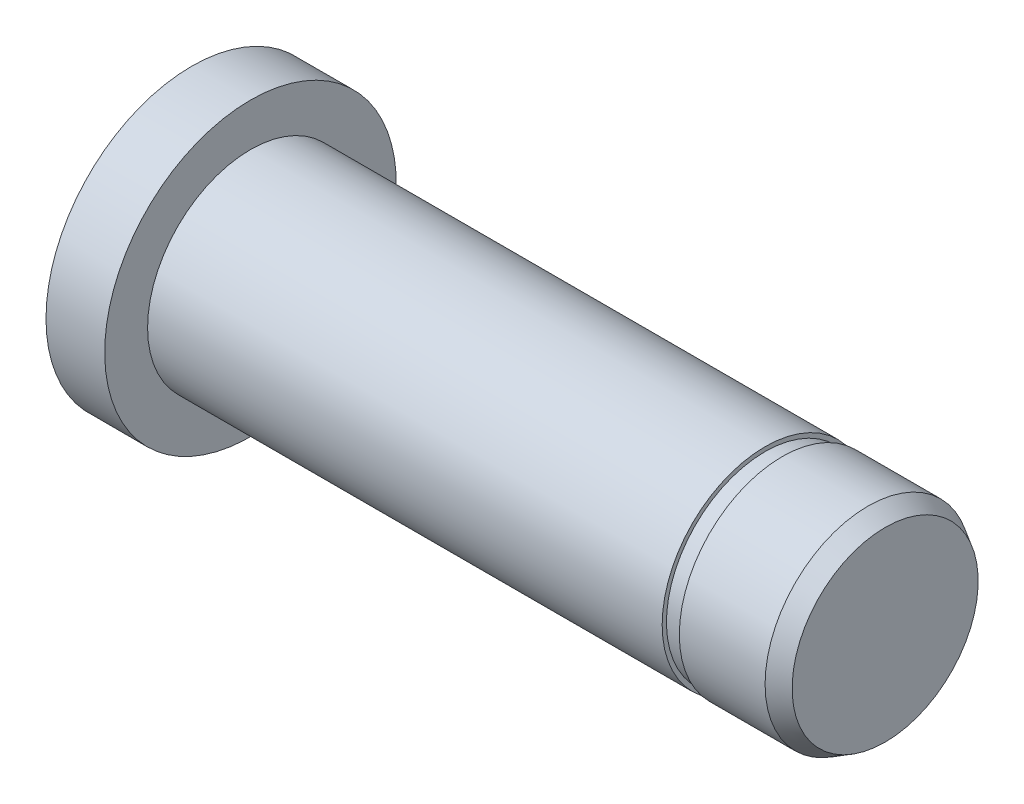
ISO-10303-21;
HEADER;
FILE_DESCRIPTION(('STEP AP214'),'2;1');
FILE_NAME('part.step','',(''),(''),'','','');
FILE_SCHEMA(('AUTOMOTIVE_DESIGN { 1 0 10303 214 1 1 1 1 }'));
ENDSEC;
DATA;
#1=APPLICATION_CONTEXT('core data for automotive mechanical design processes');
#2=APPLICATION_PROTOCOL_DEFINITION('international standard','automotive_design',2000,#1);
#3=PRODUCT_CONTEXT('',#1,'mechanical');
#4=PRODUCT('Part','Part','',(#3));
#5=PRODUCT_RELATED_PRODUCT_CATEGORY('part','',(#4));
#6=PRODUCT_DEFINITION_FORMATION('','',#4);
#7=PRODUCT_DEFINITION_CONTEXT('part definition',#1,'design');
#8=PRODUCT_DEFINITION('design','',#6,#7);
#9=PRODUCT_DEFINITION_SHAPE('','',#8);
#10=(LENGTH_UNIT() NAMED_UNIT(*) SI_UNIT(.MILLI.,.METRE.));
#11=(NAMED_UNIT(*) PLANE_ANGLE_UNIT() SI_UNIT($,.RADIAN.));
#12=(NAMED_UNIT(*) SI_UNIT($,.STERADIAN.) SOLID_ANGLE_UNIT());
#13=UNCERTAINTY_MEASURE_WITH_UNIT(LENGTH_MEASURE(1.E-05),#10,'distance_accuracy_value','');
#14=(GEOMETRIC_REPRESENTATION_CONTEXT(3) GLOBAL_UNCERTAINTY_ASSIGNED_CONTEXT((#13)) GLOBAL_UNIT_ASSIGNED_CONTEXT((#10,
#11,#12)) REPRESENTATION_CONTEXT('',''));
#15=CARTESIAN_POINT('',(0.,0.,0.));
#16=DIRECTION('',(0.,0.,1.));
#17=DIRECTION('',(1.,0.,0.));
#18=AXIS2_PLACEMENT_3D('',#15,#16,#17);
#19=CARTESIAN_POINT('',(41.,0.,0.));
#20=DIRECTION('',(1.,0.,0.));
#21=DIRECTION('',(0.,1.,0.));
#22=AXIS2_PLACEMENT_3D('',#19,#20,#21);
#23=CYLINDRICAL_SURFACE('',#22,6.);
#24=CARTESIAN_POINT('',(4.,0.,0.));
#25=DIRECTION('',(1.,0.,0.));
#26=DIRECTION('',(0.,1.,0.));
#27=AXIS2_PLACEMENT_3D('',#24,#25,#26);
#28=CIRCLE('',#27,6.);
#29=CARTESIAN_POINT('',(4.,6.,0.));
#30=VERTEX_POINT('',#29);
#31=EDGE_CURVE('E60',#30,#30,#28,.T.);
#32=ORIENTED_EDGE('',*,*,#31,.T.);
#33=EDGE_LOOP('',(#32));
#34=FACE_BOUND('',#33,.T.);
#35=CARTESIAN_POINT('',(34.,0.,0.));
#36=DIRECTION('',(1.,0.,0.));
#37=DIRECTION('',(0.,1.,0.));
#38=AXIS2_PLACEMENT_3D('',#35,#36,#37);
#39=CIRCLE('',#38,6.);
#40=CARTESIAN_POINT('',(34.,6.,0.));
#41=VERTEX_POINT('',#40);
#42=EDGE_CURVE('E63',#41,#41,#39,.T.);
#43=ORIENTED_EDGE('',*,*,#42,.F.);
#44=EDGE_LOOP('',(#43));
#45=FACE_BOUND('',#44,.T.);
#46=ADVANCED_FACE('F36',(#34,#45),#23,.T.);
#47=CARTESIAN_POINT('',(0.,0.,0.));
#48=DIRECTION('',(-1.,0.,0.));
#49=DIRECTION('',(0.,-1.,0.));
#50=AXIS2_PLACEMENT_3D('',#47,#48,#49);
#51=PLANE('',#50);
#52=CARTESIAN_POINT('',(0.,0.,0.));
#53=DIRECTION('',(-1.,0.,0.));
#54=DIRECTION('',(0.,-1.,0.));
#55=AXIS2_PLACEMENT_3D('',#52,#53,#54);
#56=CIRCLE('',#55,7.5);
#57=CARTESIAN_POINT('',(0.,-7.5,0.));
#58=VERTEX_POINT('',#57);
#59=EDGE_CURVE('E10',#58,#58,#56,.T.);
#60=ORIENTED_EDGE('',*,*,#59,.T.);
#61=EDGE_LOOP('',(#60));
#62=FACE_BOUND('',#61,.T.);
#63=ADVANCED_FACE('F87',(#62),#51,.T.);
#64=CARTESIAN_POINT('',(41.,0.,0.));
#65=DIRECTION('',(1.,0.,0.));
#66=DIRECTION('',(0.,1.,0.));
#67=AXIS2_PLACEMENT_3D('',#64,#65,#66);
#68=CYLINDRICAL_SURFACE('',#67,8.5);
#69=CARTESIAN_POINT('',(0.577350269189626,0.,0.));
#70=DIRECTION('',(-1.,0.,0.));
#71=DIRECTION('',(0.,-1.,0.));
#72=AXIS2_PLACEMENT_3D('',#69,#70,#71);
#73=CIRCLE('',#72,8.5);
#74=CARTESIAN_POINT('',(0.577350269189626,-8.5,0.));
#75=VERTEX_POINT('',#74);
#76=EDGE_CURVE('E44',#75,#75,#73,.F.);
#77=ORIENTED_EDGE('',*,*,#76,.T.);
#78=EDGE_LOOP('',(#77));
#79=FACE_BOUND('',#78,.T.);
#80=CARTESIAN_POINT('',(4.,0.,0.));
#81=DIRECTION('',(1.,0.,0.));
#82=DIRECTION('',(0.,1.,0.));
#83=AXIS2_PLACEMENT_3D('',#80,#81,#82);
#84=CIRCLE('',#83,8.5);
#85=CARTESIAN_POINT('',(4.,8.5,0.));
#86=VERTEX_POINT('',#85);
#87=EDGE_CURVE('E57',#86,#86,#84,.T.);
#88=ORIENTED_EDGE('',*,*,#87,.F.);
#89=EDGE_LOOP('',(#88));
#90=FACE_BOUND('',#89,.T.);
#91=ADVANCED_FACE('F94',(#79,#90),#68,.T.);
#92=CARTESIAN_POINT('',(4.,8.5,0.));
#93=DIRECTION('',(1.,0.,0.));
#94=DIRECTION('',(0.,1.,0.));
#95=AXIS2_PLACEMENT_3D('',#92,#93,#94);
#96=PLANE('',#95);
#97=ORIENTED_EDGE('',*,*,#87,.T.);
#98=EDGE_LOOP('',(#97));
#99=FACE_BOUND('',#98,.T.);
#100=ORIENTED_EDGE('',*,*,#31,.F.);
#101=EDGE_LOOP('',(#100));
#102=FACE_BOUND('',#101,.T.);
#103=ADVANCED_FACE('F141',(#99,#102),#96,.T.);
#104=CARTESIAN_POINT('',(0.577350269189626,0.,0.));
#105=DIRECTION('',(1.,0.,0.));
#106=DIRECTION('',(0.,1.,0.));
#107=AXIS2_PLACEMENT_3D('',#104,#105,#106);
#108=CONICAL_SURFACE('',#107,8.5,1.0471975511966);
#109=ORIENTED_EDGE('',*,*,#59,.F.);
#110=EDGE_LOOP('',(#109));
#111=FACE_BOUND('',#110,.T.);
#112=ORIENTED_EDGE('',*,*,#76,.F.);
#113=EDGE_LOOP('',(#112));
#114=FACE_BOUND('',#113,.T.);
#115=ADVANCED_FACE('F39',(#111,#114),#108,.T.);
#116=CARTESIAN_POINT('',(34.,0.,0.));
#117=DIRECTION('',(1.,0.,0.));
#118=DIRECTION('',(0.,1.,0.));
#119=AXIS2_PLACEMENT_3D('',#116,#117,#118);
#120=PLANE('',#119);
#121=CARTESIAN_POINT('',(34.,0.,0.));
#122=DIRECTION('',(1.,0.,0.));
#123=DIRECTION('',(0.,1.,0.));
#124=AXIS2_PLACEMENT_3D('',#121,#122,#123);
#125=CIRCLE('',#124,5.75);
#126=CARTESIAN_POINT('',(34.,5.75,0.));
#127=VERTEX_POINT('',#126);
#128=EDGE_CURVE('E67',#127,#127,#125,.T.);
#129=ORIENTED_EDGE('',*,*,#128,.F.);
#130=EDGE_LOOP('',(#129));
#131=FACE_BOUND('',#130,.T.);
#132=ORIENTED_EDGE('',*,*,#42,.T.);
#133=EDGE_LOOP('',(#132));
#134=FACE_BOUND('',#133,.T.);
#135=ADVANCED_FACE('F79',(#131,#134),#120,.T.);
#136=CARTESIAN_POINT('',(35.,0.,0.));
#137=DIRECTION('',(1.,0.,0.));
#138=DIRECTION('',(0.,1.,0.));
#139=AXIS2_PLACEMENT_3D('',#136,#137,#138);
#140=PLANE('',#139);
#141=CARTESIAN_POINT('',(35.,0.,0.));
#142=DIRECTION('',(1.,0.,0.));
#143=DIRECTION('',(0.,1.,0.));
#144=AXIS2_PLACEMENT_3D('',#141,#142,#143);
#145=CIRCLE('',#144,5.75);
#146=CARTESIAN_POINT('',(35.,5.75,0.));
#147=VERTEX_POINT('',#146);
#148=EDGE_CURVE('E70',#147,#147,#145,.T.);
#149=ORIENTED_EDGE('',*,*,#148,.T.);
#150=EDGE_LOOP('',(#149));
#151=FACE_BOUND('',#150,.T.);
#152=CARTESIAN_POINT('',(35.,0.,0.));
#153=DIRECTION('',(1.,0.,0.));
#154=DIRECTION('',(0.,1.,0.));
#155=AXIS2_PLACEMENT_3D('',#152,#153,#154);
#156=CIRCLE('',#155,6.);
#157=CARTESIAN_POINT('',(35.,6.,0.));
#158=VERTEX_POINT('',#157);
#159=EDGE_CURVE('E64',#158,#158,#156,.T.);
#160=ORIENTED_EDGE('',*,*,#159,.F.);
#161=EDGE_LOOP('',(#160));
#162=FACE_BOUND('',#161,.T.);
#163=ADVANCED_FACE('F82',(#151,#162),#140,.F.);
#164=CARTESIAN_POINT('',(34.,0.,0.));
#165=DIRECTION('',(1.,0.,0.));
#166=DIRECTION('',(0.,1.,0.));
#167=AXIS2_PLACEMENT_3D('',#164,#165,#166);
#168=CYLINDRICAL_SURFACE('',#167,5.75);
#169=ORIENTED_EDGE('',*,*,#128,.T.);
#170=EDGE_LOOP('',(#169));
#171=FACE_BOUND('',#170,.T.);
#172=ORIENTED_EDGE('',*,*,#148,.F.);
#173=EDGE_LOOP('',(#172));
#174=FACE_BOUND('',#173,.T.);
#175=ADVANCED_FACE('F76',(#171,#174),#168,.T.);
#176=CARTESIAN_POINT('',(41.,6.,0.));
#177=DIRECTION('',(1.,0.,0.));
#178=DIRECTION('',(0.,1.,0.));
#179=AXIS2_PLACEMENT_3D('',#176,#177,#178);
#180=PLANE('',#179);
#181=CARTESIAN_POINT('',(41.,0.,0.));
#182=DIRECTION('',(1.,0.,0.));
#183=DIRECTION('',(0.,1.,0.));
#184=AXIS2_PLACEMENT_3D('',#181,#182,#183);
#185=CIRCLE('',#184,5.42264973081038);
#186=CARTESIAN_POINT('',(41.,5.42264973081038,0.));
#187=VERTEX_POINT('',#186);
#188=EDGE_CURVE('E52',#187,#187,#185,.T.);
#189=ORIENTED_EDGE('',*,*,#188,.T.);
#190=EDGE_LOOP('',(#189));
#191=FACE_BOUND('',#190,.T.);
#192=ADVANCED_FACE('F104',(#191),#180,.T.);
#193=CARTESIAN_POINT('',(41.,0.,0.));
#194=DIRECTION('',(-1.,0.,0.));
#195=DIRECTION('',(0.,-1.,0.));
#196=AXIS2_PLACEMENT_3D('',#193,#194,#195);
#197=CONICAL_SURFACE('',#196,5.42264973081038,0.523598775598294);
#198=CARTESIAN_POINT('',(40.,0.,0.));
#199=DIRECTION('',(1.,0.,0.));
#200=DIRECTION('',(0.,1.,0.));
#201=AXIS2_PLACEMENT_3D('',#198,#199,#200);
#202=CIRCLE('',#201,6.);
#203=CARTESIAN_POINT('',(40.,6.,0.));
#204=VERTEX_POINT('',#203);
#205=EDGE_CURVE('E48',#204,#204,#202,.F.);
#206=ORIENTED_EDGE('',*,*,#205,.F.);
#207=EDGE_LOOP('',(#206));
#208=FACE_BOUND('',#207,.T.);
#209=ORIENTED_EDGE('',*,*,#188,.F.);
#210=EDGE_LOOP('',(#209));
#211=FACE_BOUND('',#210,.T.);
#212=ADVANCED_FACE('F99',(#208,#211),#197,.T.);
#213=ORIENTED_EDGE('',*,*,#159,.T.);
#214=EDGE_LOOP('',(#213));
#215=FACE_BOUND('',#214,.T.);
#216=ORIENTED_EDGE('',*,*,#205,.T.);
#217=EDGE_LOOP('',(#216));
#218=FACE_BOUND('',#217,.T.);
#219=ADVANCED_FACE('F90',(#215,#218),#23,.T.);
#220=CLOSED_SHELL('',(#46,#63,#91,#103,#115,#135,#163,#175,#192,#212,#219));
#221=MANIFOLD_SOLID_BREP('B2',#220);
#222=ADVANCED_BREP_SHAPE_REPRESENTATION('',(#18,#221),#14);
#223=SHAPE_DEFINITION_REPRESENTATION(#9,#222);
ENDSEC;
END-ISO-10303-21;
